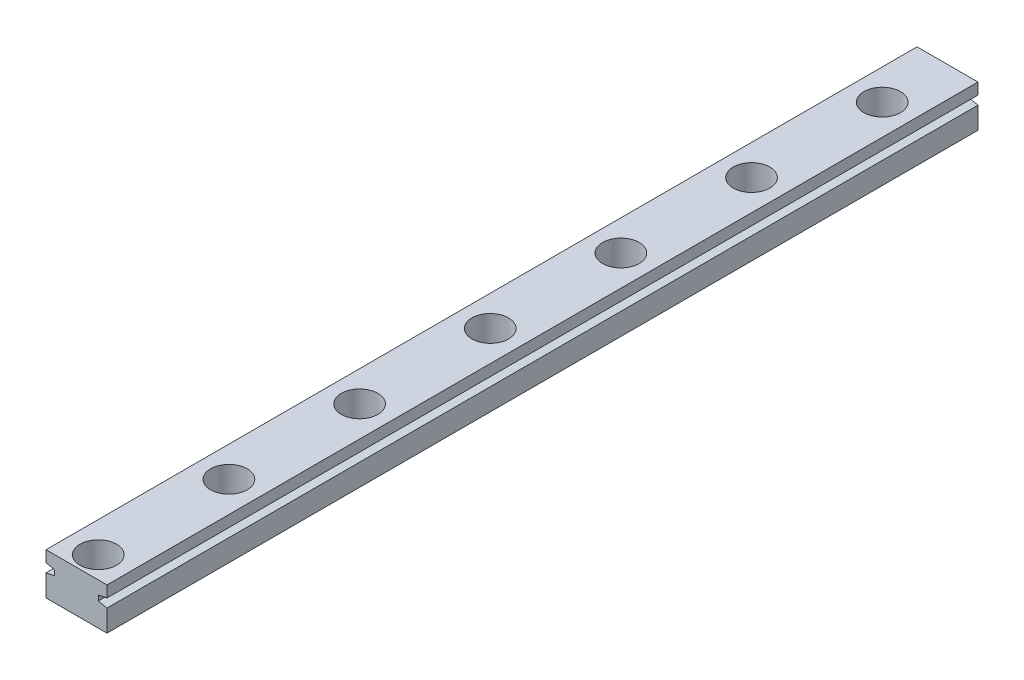
ISO-10303-21;
HEADER;
FILE_DESCRIPTION(('STEP AP214'),'2;1');
FILE_NAME('part.step','',(''),(''),'','','');
FILE_SCHEMA(('AUTOMOTIVE_DESIGN { 1 0 10303 214 1 1 1 1 }'));
ENDSEC;
DATA;
#1=APPLICATION_CONTEXT('core data for automotive mechanical design processes');
#2=APPLICATION_PROTOCOL_DEFINITION('international standard','automotive_design',2000,#1);
#3=PRODUCT_CONTEXT('',#1,'mechanical');
#4=PRODUCT('Part','Part','',(#3));
#5=PRODUCT_RELATED_PRODUCT_CATEGORY('part','',(#4));
#6=PRODUCT_DEFINITION_FORMATION('','',#4);
#7=PRODUCT_DEFINITION_CONTEXT('part definition',#1,'design');
#8=PRODUCT_DEFINITION('design','',#6,#7);
#9=PRODUCT_DEFINITION_SHAPE('','',#8);
#10=(LENGTH_UNIT() NAMED_UNIT(*) SI_UNIT(.MILLI.,.METRE.));
#11=(NAMED_UNIT(*) PLANE_ANGLE_UNIT() SI_UNIT($,.RADIAN.));
#12=(NAMED_UNIT(*) SI_UNIT($,.STERADIAN.) SOLID_ANGLE_UNIT());
#13=UNCERTAINTY_MEASURE_WITH_UNIT(LENGTH_MEASURE(1.E-05),#10,'distance_accuracy_value','');
#14=(GEOMETRIC_REPRESENTATION_CONTEXT(3) GLOBAL_UNCERTAINTY_ASSIGNED_CONTEXT((#13)) GLOBAL_UNIT_ASSIGNED_CONTEXT((#10,
#11,#12)) REPRESENTATION_CONTEXT('',''));
#15=CARTESIAN_POINT('',(0.,0.,0.));
#16=DIRECTION('',(0.,0.,1.));
#17=DIRECTION('',(1.,0.,0.));
#18=AXIS2_PLACEMENT_3D('',#15,#16,#17);
#19=CARTESIAN_POINT('',(3.5,2.4,100.));
#20=DIRECTION('',(-1.,0.,0.));
#21=DIRECTION('',(0.,-1.,0.));
#22=AXIS2_PLACEMENT_3D('',#19,#20,#21);
#23=PLANE('',#22);
#24=DIRECTION('',(0.,1.,0.));
#25=VECTOR('',#24,1.);
#26=CARTESIAN_POINT('',(3.5,2.4,100.));
#27=LINE('',#26,#25);
#28=CARTESIAN_POINT('',(3.5,1.1,100.));
#29=VERTEX_POINT('',#28);
#30=CARTESIAN_POINT('',(3.5,2.4,100.));
#31=VERTEX_POINT('',#30);
#32=EDGE_CURVE('E168',#29,#31,#27,.T.);
#33=ORIENTED_EDGE('',*,*,#32,.F.);
#34=DIRECTION('',(0.,0.,-1.));
#35=VECTOR('',#34,1.);
#36=CARTESIAN_POINT('',(3.5,1.1,100.));
#37=LINE('',#36,#35);
#38=CARTESIAN_POINT('',(3.5,1.1,0.));
#39=VERTEX_POINT('',#38);
#40=EDGE_CURVE('E223',#29,#39,#37,.T.);
#41=ORIENTED_EDGE('',*,*,#40,.T.);
#42=DIRECTION('',(0.,1.,0.));
#43=VECTOR('',#42,1.);
#44=CARTESIAN_POINT('',(3.5,2.4,0.));
#45=LINE('',#44,#43);
#46=CARTESIAN_POINT('',(3.5,2.4,0.));
#47=VERTEX_POINT('',#46);
#48=EDGE_CURVE('E162',#39,#47,#45,.T.);
#49=ORIENTED_EDGE('',*,*,#48,.T.);
#50=DIRECTION('',(0.,0.,-1.));
#51=VECTOR('',#50,1.);
#52=CARTESIAN_POINT('',(3.5,2.4,100.));
#53=LINE('',#52,#51);
#54=EDGE_CURVE('E11',#31,#47,#53,.T.);
#55=ORIENTED_EDGE('',*,*,#54,.F.);
#56=EDGE_LOOP('',(#33,#41,#49,#55));
#57=FACE_BOUND('',#56,.T.);
#58=ADVANCED_FACE('F34',(#57),#23,.F.);
#59=CARTESIAN_POINT('',(-3.5,2.4,100.));
#60=DIRECTION('',(1.,0.,0.));
#61=DIRECTION('',(0.,1.,0.));
#62=AXIS2_PLACEMENT_3D('',#59,#60,#61);
#63=PLANE('',#62);
#64=DIRECTION('',(0.,-1.,0.));
#65=VECTOR('',#64,1.);
#66=CARTESIAN_POINT('',(-3.5,2.4,100.));
#67=LINE('',#66,#65);
#68=CARTESIAN_POINT('',(-3.5,0.100000000000001,100.));
#69=VERTEX_POINT('',#68);
#70=CARTESIAN_POINT('',(-3.5,-2.4,100.));
#71=VERTEX_POINT('',#70);
#72=EDGE_CURVE('E151',#69,#71,#67,.T.);
#73=ORIENTED_EDGE('',*,*,#72,.F.);
#74=DIRECTION('',(0.,0.,-1.));
#75=VECTOR('',#74,1.);
#76=CARTESIAN_POINT('',(-3.5,0.100000000000001,100.));
#77=LINE('',#76,#75);
#78=CARTESIAN_POINT('',(-3.5,0.100000000000001,0.));
#79=VERTEX_POINT('',#78);
#80=EDGE_CURVE('E242',#69,#79,#77,.T.);
#81=ORIENTED_EDGE('',*,*,#80,.T.);
#82=DIRECTION('',(0.,-1.,0.));
#83=VECTOR('',#82,1.);
#84=CARTESIAN_POINT('',(-3.5,2.4,0.));
#85=LINE('',#84,#83);
#86=CARTESIAN_POINT('',(-3.5,-2.4,0.));
#87=VERTEX_POINT('',#86);
#88=EDGE_CURVE('E164',#79,#87,#85,.T.);
#89=ORIENTED_EDGE('',*,*,#88,.T.);
#90=DIRECTION('',(0.,0.,-1.));
#91=VECTOR('',#90,1.);
#92=CARTESIAN_POINT('',(-3.5,-2.4,100.));
#93=LINE('',#92,#91);
#94=EDGE_CURVE('E171',#71,#87,#93,.T.);
#95=ORIENTED_EDGE('',*,*,#94,.F.);
#96=EDGE_LOOP('',(#73,#81,#89,#95));
#97=FACE_BOUND('',#96,.T.);
#98=ADVANCED_FACE('F347',(#97),#63,.F.);
#99=CARTESIAN_POINT('',(9.43618446587006E-13,-2.4,97.5));
#100=DIRECTION('',(0.,1.,0.));
#101=DIRECTION('',(0.,0.,1.));
#102=AXIS2_PLACEMENT_3D('',#99,#100,#101);
#103=CYLINDRICAL_SURFACE('',#102,1.2);
#104=CARTESIAN_POINT('',(9.43618446587006E-13,-2.4,97.5));
#105=DIRECTION('',(0.,1.,0.));
#106=DIRECTION('',(0.,0.,1.));
#107=AXIS2_PLACEMENT_3D('',#104,#105,#106);
#108=CIRCLE('',#107,1.2);
#109=CARTESIAN_POINT('',(9.43618446587006E-13,-2.4,98.7));
#110=VERTEX_POINT('',#109);
#111=EDGE_CURVE('E195',#110,#110,#108,.T.);
#112=ORIENTED_EDGE('',*,*,#111,.F.);
#113=EDGE_LOOP('',(#112));
#114=FACE_BOUND('',#113,.T.);
#115=CARTESIAN_POINT('',(9.43618446587006E-13,-1.1,97.5));
#116=DIRECTION('',(0.,1.,0.));
#117=DIRECTION('',(0.,0.,1.));
#118=AXIS2_PLACEMENT_3D('',#115,#116,#117);
#119=CIRCLE('',#118,1.2);
#120=CARTESIAN_POINT('',(9.43618446587006E-13,-1.1,98.7));
#121=VERTEX_POINT('',#120);
#122=EDGE_CURVE('E38',#121,#121,#119,.F.);
#123=ORIENTED_EDGE('',*,*,#122,.F.);
#124=EDGE_LOOP('',(#123));
#125=FACE_BOUND('',#124,.T.);
#126=ADVANCED_FACE('F351',(#114,#125),#103,.F.);
#127=CARTESIAN_POINT('',(7.86501786339065E-13,-2.4,82.5));
#128=DIRECTION('',(0.,1.,0.));
#129=DIRECTION('',(0.,0.,1.));
#130=AXIS2_PLACEMENT_3D('',#127,#128,#129);
#131=CYLINDRICAL_SURFACE('',#130,1.2);
#132=CARTESIAN_POINT('',(7.86501786339065E-13,-2.4,82.5));
#133=DIRECTION('',(0.,1.,0.));
#134=DIRECTION('',(0.,0.,1.));
#135=AXIS2_PLACEMENT_3D('',#132,#133,#134);
#136=CIRCLE('',#135,1.2);
#137=CARTESIAN_POINT('',(7.86501786339065E-13,-2.4,83.7));
#138=VERTEX_POINT('',#137);
#139=EDGE_CURVE('E199',#138,#138,#136,.T.);
#140=ORIENTED_EDGE('',*,*,#139,.F.);
#141=EDGE_LOOP('',(#140));
#142=FACE_BOUND('',#141,.T.);
#143=CARTESIAN_POINT('',(7.86501786339065E-13,-1.1,82.5));
#144=DIRECTION('',(0.,1.,0.));
#145=DIRECTION('',(0.,0.,1.));
#146=AXIS2_PLACEMENT_3D('',#143,#144,#145);
#147=CIRCLE('',#146,1.2);
#148=CARTESIAN_POINT('',(7.86501786339065E-13,-1.1,83.7));
#149=VERTEX_POINT('',#148);
#150=EDGE_CURVE('E190',#149,#149,#147,.F.);
#151=ORIENTED_EDGE('',*,*,#150,.F.);
#152=EDGE_LOOP('',(#151));
#153=FACE_BOUND('',#152,.T.);
#154=ADVANCED_FACE('F325',(#142,#153),#131,.F.);
#155=CARTESIAN_POINT('',(6.29385126091124E-13,-2.4,67.5));
#156=DIRECTION('',(0.,1.,0.));
#157=DIRECTION('',(0.,0.,1.));
#158=AXIS2_PLACEMENT_3D('',#155,#156,#157);
#159=CYLINDRICAL_SURFACE('',#158,1.2);
#160=CARTESIAN_POINT('',(6.29385126091124E-13,-2.4,67.5));
#161=DIRECTION('',(0.,1.,0.));
#162=DIRECTION('',(0.,0.,1.));
#163=AXIS2_PLACEMENT_3D('',#160,#161,#162);
#164=CIRCLE('',#163,1.2);
#165=CARTESIAN_POINT('',(6.29385126091124E-13,-2.4,68.7));
#166=VERTEX_POINT('',#165);
#167=EDGE_CURVE('E204',#166,#166,#164,.T.);
#168=ORIENTED_EDGE('',*,*,#167,.F.);
#169=EDGE_LOOP('',(#168));
#170=FACE_BOUND('',#169,.T.);
#171=CARTESIAN_POINT('',(6.29385126091124E-13,-1.1,67.5));
#172=DIRECTION('',(0.,1.,0.));
#173=DIRECTION('',(0.,0.,1.));
#174=AXIS2_PLACEMENT_3D('',#171,#172,#173);
#175=CIRCLE('',#174,1.2);
#176=CARTESIAN_POINT('',(6.29385126091124E-13,-1.1,68.7));
#177=VERTEX_POINT('',#176);
#178=EDGE_CURVE('E188',#177,#177,#175,.F.);
#179=ORIENTED_EDGE('',*,*,#178,.F.);
#180=EDGE_LOOP('',(#179));
#181=FACE_BOUND('',#180,.T.);
#182=ADVANCED_FACE('F321',(#170,#181),#159,.F.);
#183=CARTESIAN_POINT('',(4.72268465843183E-13,-2.4,52.5));
#184=DIRECTION('',(0.,1.,0.));
#185=DIRECTION('',(0.,0.,1.));
#186=AXIS2_PLACEMENT_3D('',#183,#184,#185);
#187=CYLINDRICAL_SURFACE('',#186,1.2);
#188=CARTESIAN_POINT('',(4.72268465843183E-13,-2.4,52.5));
#189=DIRECTION('',(0.,1.,0.));
#190=DIRECTION('',(0.,0.,1.));
#191=AXIS2_PLACEMENT_3D('',#188,#189,#190);
#192=CIRCLE('',#191,1.2);
#193=CARTESIAN_POINT('',(4.72268465843183E-13,-2.4,53.7));
#194=VERTEX_POINT('',#193);
#195=EDGE_CURVE('E313',#194,#194,#192,.T.);
#196=ORIENTED_EDGE('',*,*,#195,.F.);
#197=EDGE_LOOP('',(#196));
#198=FACE_BOUND('',#197,.T.);
#199=CARTESIAN_POINT('',(4.72268465843183E-13,-1.1,52.5));
#200=DIRECTION('',(0.,1.,0.));
#201=DIRECTION('',(0.,0.,1.));
#202=AXIS2_PLACEMENT_3D('',#199,#200,#201);
#203=CIRCLE('',#202,1.2);
#204=CARTESIAN_POINT('',(4.72268465843183E-13,-1.1,53.7));
#205=VERTEX_POINT('',#204);
#206=EDGE_CURVE('E185',#205,#205,#203,.F.);
#207=ORIENTED_EDGE('',*,*,#206,.F.);
#208=EDGE_LOOP('',(#207));
#209=FACE_BOUND('',#208,.T.);
#210=ADVANCED_FACE('F324',(#198,#209),#187,.F.);
#211=CARTESIAN_POINT('',(3.15151805595243E-13,-2.4,37.5));
#212=DIRECTION('',(0.,1.,0.));
#213=DIRECTION('',(0.,0.,1.));
#214=AXIS2_PLACEMENT_3D('',#211,#212,#213);
#215=CYLINDRICAL_SURFACE('',#214,1.2);
#216=CARTESIAN_POINT('',(3.15151805595243E-13,-2.4,37.5));
#217=DIRECTION('',(0.,1.,0.));
#218=DIRECTION('',(0.,0.,1.));
#219=AXIS2_PLACEMENT_3D('',#216,#217,#218);
#220=CIRCLE('',#219,1.2);
#221=CARTESIAN_POINT('',(3.15151805595243E-13,-2.4,38.7));
#222=VERTEX_POINT('',#221);
#223=EDGE_CURVE('E310',#222,#222,#220,.T.);
#224=ORIENTED_EDGE('',*,*,#223,.F.);
#225=EDGE_LOOP('',(#224));
#226=FACE_BOUND('',#225,.T.);
#227=CARTESIAN_POINT('',(3.15151805595243E-13,-1.1,37.5));
#228=DIRECTION('',(0.,1.,0.));
#229=DIRECTION('',(0.,0.,1.));
#230=AXIS2_PLACEMENT_3D('',#227,#228,#229);
#231=CIRCLE('',#230,1.2);
#232=CARTESIAN_POINT('',(3.15151805595243E-13,-1.1,38.7));
#233=VERTEX_POINT('',#232);
#234=EDGE_CURVE('E182',#233,#233,#231,.F.);
#235=ORIENTED_EDGE('',*,*,#234,.F.);
#236=EDGE_LOOP('',(#235));
#237=FACE_BOUND('',#236,.T.);
#238=ADVANCED_FACE('F442',(#226,#237),#215,.F.);
#239=CARTESIAN_POINT('',(1.58035145347301E-13,-2.4,22.5));
#240=DIRECTION('',(0.,1.,0.));
#241=DIRECTION('',(0.,0.,1.));
#242=AXIS2_PLACEMENT_3D('',#239,#240,#241);
#243=CYLINDRICAL_SURFACE('',#242,1.2);
#244=CARTESIAN_POINT('',(1.58035145347301E-13,-2.4,22.5));
#245=DIRECTION('',(0.,1.,0.));
#246=DIRECTION('',(0.,0.,1.));
#247=AXIS2_PLACEMENT_3D('',#244,#245,#246);
#248=CIRCLE('',#247,1.2);
#249=CARTESIAN_POINT('',(1.58035145347301E-13,-2.4,23.7));
#250=VERTEX_POINT('',#249);
#251=EDGE_CURVE('E307',#250,#250,#248,.T.);
#252=ORIENTED_EDGE('',*,*,#251,.F.);
#253=EDGE_LOOP('',(#252));
#254=FACE_BOUND('',#253,.T.);
#255=CARTESIAN_POINT('',(1.58035145347301E-13,-1.1,22.5));
#256=DIRECTION('',(0.,1.,0.));
#257=DIRECTION('',(0.,0.,1.));
#258=AXIS2_PLACEMENT_3D('',#255,#256,#257);
#259=CIRCLE('',#258,1.2);
#260=CARTESIAN_POINT('',(1.58035145347301E-13,-1.1,23.7));
#261=VERTEX_POINT('',#260);
#262=EDGE_CURVE('E178',#261,#261,#259,.F.);
#263=ORIENTED_EDGE('',*,*,#262,.F.);
#264=EDGE_LOOP('',(#263));
#265=FACE_BOUND('',#264,.T.);
#266=ADVANCED_FACE('F362',(#254,#265),#243,.F.);
#267=CARTESIAN_POINT('',(0.,-2.4,7.5));
#268=DIRECTION('',(0.,1.,0.));
#269=DIRECTION('',(0.,0.,1.));
#270=AXIS2_PLACEMENT_3D('',#267,#268,#269);
#271=CYLINDRICAL_SURFACE('',#270,1.2);
#272=CARTESIAN_POINT('',(0.,-2.4,7.5));
#273=DIRECTION('',(0.,1.,0.));
#274=DIRECTION('',(0.,0.,1.));
#275=AXIS2_PLACEMENT_3D('',#272,#273,#274);
#276=CIRCLE('',#275,1.2);
#277=CARTESIAN_POINT('',(0.,-2.4,8.7));
#278=VERTEX_POINT('',#277);
#279=EDGE_CURVE('E226',#278,#278,#276,.T.);
#280=ORIENTED_EDGE('',*,*,#279,.F.);
#281=EDGE_LOOP('',(#280));
#282=FACE_BOUND('',#281,.T.);
#283=CARTESIAN_POINT('',(0.,-1.1,7.5));
#284=DIRECTION('',(0.,1.,0.));
#285=DIRECTION('',(0.,0.,1.));
#286=AXIS2_PLACEMENT_3D('',#283,#284,#285);
#287=CIRCLE('',#286,1.2);
#288=CARTESIAN_POINT('',(0.,-1.1,8.7));
#289=VERTEX_POINT('',#288);
#290=EDGE_CURVE('E175',#289,#289,#287,.F.);
#291=ORIENTED_EDGE('',*,*,#290,.F.);
#292=EDGE_LOOP('',(#291));
#293=FACE_BOUND('',#292,.T.);
#294=ADVANCED_FACE('F355',(#282,#293),#271,.F.);
#295=CARTESIAN_POINT('',(3.5,-2.4,0.));
#296=VERTEX_POINT('',#295);
#297=CARTESIAN_POINT('',(3.5,0.0999999999999999,0.));
#298=VERTEX_POINT('',#297);
#299=EDGE_CURVE('E158',#296,#298,#45,.T.);
#300=ORIENTED_EDGE('',*,*,#299,.T.);
#301=DIRECTION('',(0.,0.,-1.));
#302=VECTOR('',#301,1.);
#303=CARTESIAN_POINT('',(3.5,0.0999999999999998,100.));
#304=LINE('',#303,#302);
#305=CARTESIAN_POINT('',(3.5,0.0999999999999998,100.));
#306=VERTEX_POINT('',#305);
#307=EDGE_CURVE('E59',#306,#298,#304,.T.);
#308=ORIENTED_EDGE('',*,*,#307,.F.);
#309=CARTESIAN_POINT('',(3.5,-2.4,100.));
#310=VERTEX_POINT('',#309);
#311=EDGE_CURVE('E207',#310,#306,#27,.T.);
#312=ORIENTED_EDGE('',*,*,#311,.F.);
#313=DIRECTION('',(0.,0.,-1.));
#314=VECTOR('',#313,1.);
#315=CARTESIAN_POINT('',(3.5,-2.4,100.));
#316=LINE('',#315,#314);
#317=EDGE_CURVE('E153',#310,#296,#316,.T.);
#318=ORIENTED_EDGE('',*,*,#317,.T.);
#319=EDGE_LOOP('',(#300,#308,#312,#318));
#320=FACE_BOUND('',#319,.T.);
#321=ADVANCED_FACE('F36',(#320),#23,.F.);
#322=CARTESIAN_POINT('',(-3.5,2.4,100.));
#323=DIRECTION('',(0.,-1.,0.));
#324=DIRECTION('',(0.,0.,-1.));
#325=AXIS2_PLACEMENT_3D('',#322,#323,#324);
#326=PLANE('',#325);
#327=CARTESIAN_POINT('',(0.,2.4,7.5));
#328=DIRECTION('',(0.,1.,0.));
#329=DIRECTION('',(0.,0.,1.));
#330=AXIS2_PLACEMENT_3D('',#327,#328,#329);
#331=CIRCLE('',#330,2.1);
#332=CARTESIAN_POINT('',(0.,2.4,9.6));
#333=VERTEX_POINT('',#332);
#334=EDGE_CURVE('E267',#333,#333,#331,.T.);
#335=ORIENTED_EDGE('',*,*,#334,.F.);
#336=EDGE_LOOP('',(#335));
#337=FACE_BOUND('',#336,.T.);
#338=CARTESIAN_POINT('',(9.43618446587006E-13,2.4,97.5));
#339=DIRECTION('',(0.,1.,0.));
#340=DIRECTION('',(0.,0.,1.));
#341=AXIS2_PLACEMENT_3D('',#338,#339,#340);
#342=CIRCLE('',#341,2.1);
#343=CARTESIAN_POINT('',(9.43618446587006E-13,2.4,99.6));
#344=VERTEX_POINT('',#343);
#345=EDGE_CURVE('E245',#344,#344,#342,.T.);
#346=ORIENTED_EDGE('',*,*,#345,.F.);
#347=EDGE_LOOP('',(#346));
#348=FACE_BOUND('',#347,.T.);
#349=CARTESIAN_POINT('',(7.86501786339065E-13,2.4,82.5));
#350=DIRECTION('',(0.,1.,0.));
#351=DIRECTION('',(0.,0.,1.));
#352=AXIS2_PLACEMENT_3D('',#349,#350,#351);
#353=CIRCLE('',#352,2.1);
#354=CARTESIAN_POINT('',(7.86501786339065E-13,2.4,84.6));
#355=VERTEX_POINT('',#354);
#356=EDGE_CURVE('E281',#355,#355,#353,.T.);
#357=ORIENTED_EDGE('',*,*,#356,.F.);
#358=EDGE_LOOP('',(#357));
#359=FACE_BOUND('',#358,.T.);
#360=CARTESIAN_POINT('',(6.29385126091124E-13,2.4,67.5));
#361=DIRECTION('',(0.,1.,0.));
#362=DIRECTION('',(0.,0.,1.));
#363=AXIS2_PLACEMENT_3D('',#360,#361,#362);
#364=CIRCLE('',#363,2.1);
#365=CARTESIAN_POINT('',(6.29385126091124E-13,2.4,69.6));
#366=VERTEX_POINT('',#365);
#367=EDGE_CURVE('E275',#366,#366,#364,.T.);
#368=ORIENTED_EDGE('',*,*,#367,.F.);
#369=EDGE_LOOP('',(#368));
#370=FACE_BOUND('',#369,.T.);
#371=CARTESIAN_POINT('',(1.58035145347301E-13,2.4,22.5));
#372=DIRECTION('',(0.,1.,0.));
#373=DIRECTION('',(0.,0.,1.));
#374=AXIS2_PLACEMENT_3D('',#371,#372,#373);
#375=CIRCLE('',#374,2.1);
#376=CARTESIAN_POINT('',(1.58035145347301E-13,2.4,24.6));
#377=VERTEX_POINT('',#376);
#378=EDGE_CURVE('E292',#377,#377,#375,.T.);
#379=ORIENTED_EDGE('',*,*,#378,.F.);
#380=EDGE_LOOP('',(#379));
#381=FACE_BOUND('',#380,.T.);
#382=CARTESIAN_POINT('',(3.15151805595243E-13,2.4,37.5));
#383=DIRECTION('',(0.,1.,0.));
#384=DIRECTION('',(0.,0.,1.));
#385=AXIS2_PLACEMENT_3D('',#382,#383,#384);
#386=CIRCLE('',#385,2.1);
#387=CARTESIAN_POINT('',(3.15151805595243E-13,2.4,39.6));
#388=VERTEX_POINT('',#387);
#389=EDGE_CURVE('E293',#388,#388,#386,.T.);
#390=ORIENTED_EDGE('',*,*,#389,.F.);
#391=EDGE_LOOP('',(#390));
#392=FACE_BOUND('',#391,.T.);
#393=CARTESIAN_POINT('',(4.72268465843183E-13,2.4,52.5));
#394=DIRECTION('',(0.,1.,0.));
#395=DIRECTION('',(0.,0.,1.));
#396=AXIS2_PLACEMENT_3D('',#393,#394,#395);
#397=CIRCLE('',#396,2.1);
#398=CARTESIAN_POINT('',(4.72268465843183E-13,2.4,54.6));
#399=VERTEX_POINT('',#398);
#400=EDGE_CURVE('E274',#399,#399,#397,.T.);
#401=ORIENTED_EDGE('',*,*,#400,.F.);
#402=EDGE_LOOP('',(#401));
#403=FACE_BOUND('',#402,.T.);
#404=DIRECTION('',(-1.,0.,0.));
#405=VECTOR('',#404,1.);
#406=CARTESIAN_POINT('',(-3.5,2.4,0.));
#407=LINE('',#406,#405);
#408=CARTESIAN_POINT('',(-3.5,2.4,0.));
#409=VERTEX_POINT('',#408);
#410=EDGE_CURVE('E161',#47,#409,#407,.T.);
#411=ORIENTED_EDGE('',*,*,#410,.T.);
#412=DIRECTION('',(0.,0.,-1.));
#413=VECTOR('',#412,1.);
#414=CARTESIAN_POINT('',(-3.5,2.4,100.));
#415=LINE('',#414,#413);
#416=CARTESIAN_POINT('',(-3.5,2.4,100.));
#417=VERTEX_POINT('',#416);
#418=EDGE_CURVE('E43',#417,#409,#415,.T.);
#419=ORIENTED_EDGE('',*,*,#418,.F.);
#420=DIRECTION('',(-1.,0.,0.));
#421=VECTOR('',#420,1.);
#422=CARTESIAN_POINT('',(-3.5,2.4,100.));
#423=LINE('',#422,#421);
#424=EDGE_CURVE('E148',#31,#417,#423,.T.);
#425=ORIENTED_EDGE('',*,*,#424,.F.);
#426=ORIENTED_EDGE('',*,*,#54,.T.);
#427=EDGE_LOOP('',(#411,#419,#425,#426));
#428=FACE_BOUND('',#427,.T.);
#429=ADVANCED_FACE('F220',(#337,#348,#359,#370,#381,#392,#403,#428),#326,.F.);
#430=CARTESIAN_POINT('',(-3.5,1.1,0.));
#431=VERTEX_POINT('',#430);
#432=EDGE_CURVE('E142',#409,#431,#85,.T.);
#433=ORIENTED_EDGE('',*,*,#432,.T.);
#434=DIRECTION('',(0.,0.,-1.));
#435=VECTOR('',#434,1.);
#436=CARTESIAN_POINT('',(-3.5,1.1,100.));
#437=LINE('',#436,#435);
#438=CARTESIAN_POINT('',(-3.5,1.1,100.));
#439=VERTEX_POINT('',#438);
#440=EDGE_CURVE('E51',#439,#431,#437,.T.);
#441=ORIENTED_EDGE('',*,*,#440,.F.);
#442=EDGE_CURVE('E140',#417,#439,#67,.T.);
#443=ORIENTED_EDGE('',*,*,#442,.F.);
#444=ORIENTED_EDGE('',*,*,#418,.T.);
#445=EDGE_LOOP('',(#433,#441,#443,#444));
#446=FACE_BOUND('',#445,.T.);
#447=ADVANCED_FACE('F138',(#446),#63,.F.);
#448=CARTESIAN_POINT('',(-3.5,-2.4,100.));
#449=DIRECTION('',(0.,1.,0.));
#450=DIRECTION('',(0.,0.,1.));
#451=AXIS2_PLACEMENT_3D('',#448,#449,#450);
#452=PLANE('',#451);
#453=ORIENTED_EDGE('',*,*,#279,.T.);
#454=EDGE_LOOP('',(#453));
#455=FACE_BOUND('',#454,.T.);
#456=ORIENTED_EDGE('',*,*,#251,.T.);
#457=EDGE_LOOP('',(#456));
#458=FACE_BOUND('',#457,.T.);
#459=ORIENTED_EDGE('',*,*,#223,.T.);
#460=EDGE_LOOP('',(#459));
#461=FACE_BOUND('',#460,.T.);
#462=ORIENTED_EDGE('',*,*,#195,.T.);
#463=EDGE_LOOP('',(#462));
#464=FACE_BOUND('',#463,.T.);
#465=ORIENTED_EDGE('',*,*,#167,.T.);
#466=EDGE_LOOP('',(#465));
#467=FACE_BOUND('',#466,.T.);
#468=ORIENTED_EDGE('',*,*,#139,.T.);
#469=EDGE_LOOP('',(#468));
#470=FACE_BOUND('',#469,.T.);
#471=ORIENTED_EDGE('',*,*,#111,.T.);
#472=EDGE_LOOP('',(#471));
#473=FACE_BOUND('',#472,.T.);
#474=DIRECTION('',(1.,0.,0.));
#475=VECTOR('',#474,1.);
#476=CARTESIAN_POINT('',(-3.5,-2.4,0.));
#477=LINE('',#476,#475);
#478=EDGE_CURVE('E166',#87,#296,#477,.T.);
#479=ORIENTED_EDGE('',*,*,#478,.T.);
#480=ORIENTED_EDGE('',*,*,#317,.F.);
#481=DIRECTION('',(1.,0.,0.));
#482=VECTOR('',#481,1.);
#483=CARTESIAN_POINT('',(-3.5,-2.4,100.));
#484=LINE('',#483,#482);
#485=EDGE_CURVE('E150',#71,#310,#484,.T.);
#486=ORIENTED_EDGE('',*,*,#485,.F.);
#487=ORIENTED_EDGE('',*,*,#94,.T.);
#488=EDGE_LOOP('',(#479,#480,#486,#487));
#489=FACE_BOUND('',#488,.T.);
#490=ADVANCED_FACE('F318',(#455,#458,#461,#464,#467,#470,#473,#489),#452,.F.);
#491=CARTESIAN_POINT('',(0.,0.,100.));
#492=DIRECTION('',(0.,0.,1.));
#493=DIRECTION('',(1.,0.,0.));
#494=AXIS2_PLACEMENT_3D('',#491,#492,#493);
#495=PLANE('',#494);
#496=DIRECTION('',(-0.98058067569092,-0.196116135138184,0.));
#497=VECTOR('',#496,1.);
#498=CARTESIAN_POINT('',(-2.5,0.300000000000001,100.));
#499=LINE('',#498,#497);
#500=CARTESIAN_POINT('',(-2.5,0.300000000000001,100.));
#501=VERTEX_POINT('',#500);
#502=EDGE_CURVE('E143',#501,#69,#499,.T.);
#503=ORIENTED_EDGE('',*,*,#502,.T.);
#504=ORIENTED_EDGE('',*,*,#72,.T.);
#505=ORIENTED_EDGE('',*,*,#485,.T.);
#506=ORIENTED_EDGE('',*,*,#311,.T.);
#507=DIRECTION('',(-0.98058067569092,0.196116135138184,0.));
#508=VECTOR('',#507,1.);
#509=CARTESIAN_POINT('',(2.5,0.3,100.));
#510=LINE('',#509,#508);
#511=CARTESIAN_POINT('',(2.5,0.3,100.));
#512=VERTEX_POINT('',#511);
#513=EDGE_CURVE('E249',#306,#512,#510,.T.);
#514=ORIENTED_EDGE('',*,*,#513,.T.);
#515=DIRECTION('',(0.,1.,0.));
#516=VECTOR('',#515,1.);
#517=CARTESIAN_POINT('',(2.5,0.900000000000001,100.));
#518=LINE('',#517,#516);
#519=CARTESIAN_POINT('',(2.5,0.900000000000001,100.));
#520=VERTEX_POINT('',#519);
#521=EDGE_CURVE('E251',#512,#520,#518,.T.);
#522=ORIENTED_EDGE('',*,*,#521,.T.);
#523=DIRECTION('',(0.98058067569092,0.196116135138184,0.));
#524=VECTOR('',#523,1.);
#525=CARTESIAN_POINT('',(3.5,1.1,100.));
#526=LINE('',#525,#524);
#527=EDGE_CURVE('E215',#520,#29,#526,.T.);
#528=ORIENTED_EDGE('',*,*,#527,.T.);
#529=ORIENTED_EDGE('',*,*,#32,.T.);
#530=ORIENTED_EDGE('',*,*,#424,.T.);
#531=ORIENTED_EDGE('',*,*,#442,.T.);
#532=DIRECTION('',(0.98058067569092,-0.196116135138184,0.));
#533=VECTOR('',#532,1.);
#534=CARTESIAN_POINT('',(-3.5,1.1,100.));
#535=LINE('',#534,#533);
#536=CARTESIAN_POINT('',(-2.5,0.900000000000001,100.));
#537=VERTEX_POINT('',#536);
#538=EDGE_CURVE('E125',#439,#537,#535,.T.);
#539=ORIENTED_EDGE('',*,*,#538,.T.);
#540=DIRECTION('',(0.,-1.,0.));
#541=VECTOR('',#540,1.);
#542=CARTESIAN_POINT('',(-2.5,0.900000000000001,100.));
#543=LINE('',#542,#541);
#544=EDGE_CURVE('E132',#537,#501,#543,.T.);
#545=ORIENTED_EDGE('',*,*,#544,.T.);
#546=EDGE_LOOP('',(#503,#504,#505,#506,#514,#522,#528,#529,#530,#531,#539,#545));
#547=FACE_BOUND('',#546,.T.);
#548=ADVANCED_FACE('F146',(#547),#495,.T.);
#549=CARTESIAN_POINT('',(0.,0.,0.));
#550=DIRECTION('',(0.,0.,1.));
#551=DIRECTION('',(1.,0.,0.));
#552=AXIS2_PLACEMENT_3D('',#549,#550,#551);
#553=PLANE('',#552);
#554=ORIENTED_EDGE('',*,*,#88,.F.);
#555=DIRECTION('',(-0.98058067569092,-0.196116135138184,0.));
#556=VECTOR('',#555,1.);
#557=CARTESIAN_POINT('',(-2.5,0.300000000000001,0.));
#558=LINE('',#557,#556);
#559=CARTESIAN_POINT('',(-2.5,0.300000000000001,0.));
#560=VERTEX_POINT('',#559);
#561=EDGE_CURVE('E133',#560,#79,#558,.T.);
#562=ORIENTED_EDGE('',*,*,#561,.F.);
#563=DIRECTION('',(0.,-1.,0.));
#564=VECTOR('',#563,1.);
#565=CARTESIAN_POINT('',(-2.5,0.900000000000001,0.));
#566=LINE('',#565,#564);
#567=CARTESIAN_POINT('',(-2.5,0.900000000000001,0.));
#568=VERTEX_POINT('',#567);
#569=EDGE_CURVE('E233',#568,#560,#566,.T.);
#570=ORIENTED_EDGE('',*,*,#569,.F.);
#571=DIRECTION('',(0.98058067569092,-0.196116135138184,0.));
#572=VECTOR('',#571,1.);
#573=CARTESIAN_POINT('',(-3.5,1.1,0.));
#574=LINE('',#573,#572);
#575=EDGE_CURVE('E230',#431,#568,#574,.T.);
#576=ORIENTED_EDGE('',*,*,#575,.F.);
#577=ORIENTED_EDGE('',*,*,#432,.F.);
#578=ORIENTED_EDGE('',*,*,#410,.F.);
#579=ORIENTED_EDGE('',*,*,#48,.F.);
#580=DIRECTION('',(0.98058067569092,0.196116135138184,0.));
#581=VECTOR('',#580,1.);
#582=CARTESIAN_POINT('',(3.5,1.1,0.));
#583=LINE('',#582,#581);
#584=CARTESIAN_POINT('',(2.5,0.900000000000001,0.));
#585=VERTEX_POINT('',#584);
#586=EDGE_CURVE('E252',#585,#39,#583,.T.);
#587=ORIENTED_EDGE('',*,*,#586,.F.);
#588=DIRECTION('',(0.,1.,0.));
#589=VECTOR('',#588,1.);
#590=CARTESIAN_POINT('',(2.5,0.900000000000001,0.));
#591=LINE('',#590,#589);
#592=CARTESIAN_POINT('',(2.5,0.3,0.));
#593=VERTEX_POINT('',#592);
#594=EDGE_CURVE('E257',#593,#585,#591,.T.);
#595=ORIENTED_EDGE('',*,*,#594,.F.);
#596=DIRECTION('',(-0.98058067569092,0.196116135138184,0.));
#597=VECTOR('',#596,1.);
#598=CARTESIAN_POINT('',(2.5,0.3,0.));
#599=LINE('',#598,#597);
#600=EDGE_CURVE('E255',#298,#593,#599,.T.);
#601=ORIENTED_EDGE('',*,*,#600,.F.);
#602=ORIENTED_EDGE('',*,*,#299,.F.);
#603=ORIENTED_EDGE('',*,*,#478,.F.);
#604=EDGE_LOOP('',(#554,#562,#570,#576,#577,#578,#579,#587,#595,#601,#602,#603));
#605=FACE_BOUND('',#604,.T.);
#606=ADVANCED_FACE('F228',(#605),#553,.F.);
#607=CARTESIAN_POINT('',(0.,-1.1,7.5));
#608=DIRECTION('',(0.,1.,0.));
#609=DIRECTION('',(0.,0.,1.));
#610=AXIS2_PLACEMENT_3D('',#607,#608,#609);
#611=PLANE('',#610);
#612=CARTESIAN_POINT('',(0.,-1.1,7.5));
#613=DIRECTION('',(0.,1.,0.));
#614=DIRECTION('',(0.,0.,1.));
#615=AXIS2_PLACEMENT_3D('',#612,#613,#614);
#616=CIRCLE('',#615,2.1);
#617=CARTESIAN_POINT('',(0.,-1.1,9.6));
#618=VERTEX_POINT('',#617);
#619=EDGE_CURVE('E179',#618,#618,#616,.T.);
#620=ORIENTED_EDGE('',*,*,#619,.T.);
#621=EDGE_LOOP('',(#620));
#622=FACE_BOUND('',#621,.T.);
#623=ORIENTED_EDGE('',*,*,#290,.T.);
#624=EDGE_LOOP('',(#623));
#625=FACE_BOUND('',#624,.T.);
#626=ADVANCED_FACE('F392',(#622,#625),#611,.T.);
#627=CARTESIAN_POINT('',(0.,-1.1,7.5));
#628=DIRECTION('',(0.,1.,0.));
#629=DIRECTION('',(0.,0.,1.));
#630=AXIS2_PLACEMENT_3D('',#627,#628,#629);
#631=CYLINDRICAL_SURFACE('',#630,2.1);
#632=ORIENTED_EDGE('',*,*,#619,.F.);
#633=EDGE_LOOP('',(#632));
#634=FACE_BOUND('',#633,.T.);
#635=ORIENTED_EDGE('',*,*,#334,.T.);
#636=EDGE_LOOP('',(#635));
#637=FACE_BOUND('',#636,.T.);
#638=ADVANCED_FACE('F394',(#634,#637),#631,.F.);
#639=CARTESIAN_POINT('',(1.58035145347301E-13,-1.1,22.5));
#640=DIRECTION('',(0.,1.,0.));
#641=DIRECTION('',(0.,0.,1.));
#642=AXIS2_PLACEMENT_3D('',#639,#640,#641);
#643=PLANE('',#642);
#644=CARTESIAN_POINT('',(1.58035145347301E-13,-1.1,22.5));
#645=DIRECTION('',(0.,1.,0.));
#646=DIRECTION('',(0.,0.,1.));
#647=AXIS2_PLACEMENT_3D('',#644,#645,#646);
#648=CIRCLE('',#647,2.1);
#649=CARTESIAN_POINT('',(1.58035145347301E-13,-1.1,24.6));
#650=VERTEX_POINT('',#649);
#651=EDGE_CURVE('E270',#650,#650,#648,.T.);
#652=ORIENTED_EDGE('',*,*,#651,.T.);
#653=EDGE_LOOP('',(#652));
#654=FACE_BOUND('',#653,.T.);
#655=ORIENTED_EDGE('',*,*,#262,.T.);
#656=EDGE_LOOP('',(#655));
#657=FACE_BOUND('',#656,.T.);
#658=ADVANCED_FACE('F397',(#654,#657),#643,.T.);
#659=CARTESIAN_POINT('',(1.58035145347301E-13,-1.1,22.5));
#660=DIRECTION('',(0.,1.,0.));
#661=DIRECTION('',(0.,0.,1.));
#662=AXIS2_PLACEMENT_3D('',#659,#660,#661);
#663=CYLINDRICAL_SURFACE('',#662,2.1);
#664=ORIENTED_EDGE('',*,*,#651,.F.);
#665=EDGE_LOOP('',(#664));
#666=FACE_BOUND('',#665,.T.);
#667=ORIENTED_EDGE('',*,*,#378,.T.);
#668=EDGE_LOOP('',(#667));
#669=FACE_BOUND('',#668,.T.);
#670=ADVANCED_FACE('F402',(#666,#669),#663,.F.);
#671=CARTESIAN_POINT('',(3.15151805595243E-13,-1.1,37.5));
#672=DIRECTION('',(0.,1.,0.));
#673=DIRECTION('',(0.,0.,1.));
#674=AXIS2_PLACEMENT_3D('',#671,#672,#673);
#675=PLANE('',#674);
#676=CARTESIAN_POINT('',(3.15151805595243E-13,-1.1,37.5));
#677=DIRECTION('',(0.,1.,0.));
#678=DIRECTION('',(0.,0.,1.));
#679=AXIS2_PLACEMENT_3D('',#676,#677,#678);
#680=CIRCLE('',#679,2.1);
#681=CARTESIAN_POINT('',(3.15151805595243E-13,-1.1,39.6));
#682=VERTEX_POINT('',#681);
#683=EDGE_CURVE('E289',#682,#682,#680,.T.);
#684=ORIENTED_EDGE('',*,*,#683,.T.);
#685=EDGE_LOOP('',(#684));
#686=FACE_BOUND('',#685,.T.);
#687=ORIENTED_EDGE('',*,*,#234,.T.);
#688=EDGE_LOOP('',(#687));
#689=FACE_BOUND('',#688,.T.);
#690=ADVANCED_FACE('F424',(#686,#689),#675,.T.);
#691=CARTESIAN_POINT('',(3.15151805595243E-13,-1.1,37.5));
#692=DIRECTION('',(0.,1.,0.));
#693=DIRECTION('',(0.,0.,1.));
#694=AXIS2_PLACEMENT_3D('',#691,#692,#693);
#695=CYLINDRICAL_SURFACE('',#694,2.1);
#696=ORIENTED_EDGE('',*,*,#683,.F.);
#697=EDGE_LOOP('',(#696));
#698=FACE_BOUND('',#697,.T.);
#699=ORIENTED_EDGE('',*,*,#389,.T.);
#700=EDGE_LOOP('',(#699));
#701=FACE_BOUND('',#700,.T.);
#702=ADVANCED_FACE('F422',(#698,#701),#695,.F.);
#703=CARTESIAN_POINT('',(4.72268465843183E-13,-1.1,52.5));
#704=DIRECTION('',(0.,1.,0.));
#705=DIRECTION('',(0.,0.,1.));
#706=AXIS2_PLACEMENT_3D('',#703,#704,#705);
#707=PLANE('',#706);
#708=CARTESIAN_POINT('',(4.72268465843183E-13,-1.1,52.5));
#709=DIRECTION('',(0.,1.,0.));
#710=DIRECTION('',(0.,0.,1.));
#711=AXIS2_PLACEMENT_3D('',#708,#709,#710);
#712=CIRCLE('',#711,2.1);
#713=CARTESIAN_POINT('',(4.72268465843183E-13,-1.1,54.6));
#714=VERTEX_POINT('',#713);
#715=EDGE_CURVE('E296',#714,#714,#712,.T.);
#716=ORIENTED_EDGE('',*,*,#715,.T.);
#717=EDGE_LOOP('',(#716));
#718=FACE_BOUND('',#717,.T.);
#719=ORIENTED_EDGE('',*,*,#206,.T.);
#720=EDGE_LOOP('',(#719));
#721=FACE_BOUND('',#720,.T.);
#722=ADVANCED_FACE('F342',(#718,#721),#707,.T.);
#723=CARTESIAN_POINT('',(4.72268465843183E-13,-1.1,52.5));
#724=DIRECTION('',(0.,1.,0.));
#725=DIRECTION('',(0.,0.,1.));
#726=AXIS2_PLACEMENT_3D('',#723,#724,#725);
#727=CYLINDRICAL_SURFACE('',#726,2.1);
#728=ORIENTED_EDGE('',*,*,#715,.F.);
#729=EDGE_LOOP('',(#728));
#730=FACE_BOUND('',#729,.T.);
#731=ORIENTED_EDGE('',*,*,#400,.T.);
#732=EDGE_LOOP('',(#731));
#733=FACE_BOUND('',#732,.T.);
#734=ADVANCED_FACE('F332',(#730,#733),#727,.F.);
#735=CARTESIAN_POINT('',(6.29385126091124E-13,-1.1,67.5));
#736=DIRECTION('',(0.,1.,0.));
#737=DIRECTION('',(0.,0.,1.));
#738=AXIS2_PLACEMENT_3D('',#735,#736,#737);
#739=PLANE('',#738);
#740=CARTESIAN_POINT('',(6.29385126091124E-13,-1.1,67.5));
#741=DIRECTION('',(0.,1.,0.));
#742=DIRECTION('',(0.,0.,1.));
#743=AXIS2_PLACEMENT_3D('',#740,#741,#742);
#744=CIRCLE('',#743,2.1);
#745=CARTESIAN_POINT('',(6.29385126091124E-13,-1.1,69.6));
#746=VERTEX_POINT('',#745);
#747=EDGE_CURVE('E271',#746,#746,#744,.T.);
#748=ORIENTED_EDGE('',*,*,#747,.T.);
#749=EDGE_LOOP('',(#748));
#750=FACE_BOUND('',#749,.T.);
#751=ORIENTED_EDGE('',*,*,#178,.T.);
#752=EDGE_LOOP('',(#751));
#753=FACE_BOUND('',#752,.T.);
#754=ADVANCED_FACE('F329',(#750,#753),#739,.T.);
#755=CARTESIAN_POINT('',(6.29385126091124E-13,-1.1,67.5));
#756=DIRECTION('',(0.,1.,0.));
#757=DIRECTION('',(0.,0.,1.));
#758=AXIS2_PLACEMENT_3D('',#755,#756,#757);
#759=CYLINDRICAL_SURFACE('',#758,2.1);
#760=ORIENTED_EDGE('',*,*,#747,.F.);
#761=EDGE_LOOP('',(#760));
#762=FACE_BOUND('',#761,.T.);
#763=ORIENTED_EDGE('',*,*,#367,.T.);
#764=EDGE_LOOP('',(#763));
#765=FACE_BOUND('',#764,.T.);
#766=ADVANCED_FACE('F331',(#762,#765),#759,.F.);
#767=CARTESIAN_POINT('',(7.86501786339065E-13,-1.1,82.5));
#768=DIRECTION('',(0.,1.,0.));
#769=DIRECTION('',(0.,0.,1.));
#770=AXIS2_PLACEMENT_3D('',#767,#768,#769);
#771=PLANE('',#770);
#772=CARTESIAN_POINT('',(7.86501786339065E-13,-1.1,82.5));
#773=DIRECTION('',(0.,1.,0.));
#774=DIRECTION('',(0.,0.,1.));
#775=AXIS2_PLACEMENT_3D('',#772,#773,#774);
#776=CIRCLE('',#775,2.1);
#777=CARTESIAN_POINT('',(7.86501786339065E-13,-1.1,84.6));
#778=VERTEX_POINT('',#777);
#779=EDGE_CURVE('E278',#778,#778,#776,.T.);
#780=ORIENTED_EDGE('',*,*,#779,.T.);
#781=EDGE_LOOP('',(#780));
#782=FACE_BOUND('',#781,.T.);
#783=ORIENTED_EDGE('',*,*,#150,.T.);
#784=EDGE_LOOP('',(#783));
#785=FACE_BOUND('',#784,.T.);
#786=ADVANCED_FACE('F339',(#782,#785),#771,.T.);
#787=CARTESIAN_POINT('',(7.86501786339065E-13,-1.1,82.5));
#788=DIRECTION('',(0.,1.,0.));
#789=DIRECTION('',(0.,0.,1.));
#790=AXIS2_PLACEMENT_3D('',#787,#788,#789);
#791=CYLINDRICAL_SURFACE('',#790,2.1);
#792=ORIENTED_EDGE('',*,*,#779,.F.);
#793=EDGE_LOOP('',(#792));
#794=FACE_BOUND('',#793,.T.);
#795=ORIENTED_EDGE('',*,*,#356,.T.);
#796=EDGE_LOOP('',(#795));
#797=FACE_BOUND('',#796,.T.);
#798=ADVANCED_FACE('F545',(#794,#797),#791,.F.);
#799=CARTESIAN_POINT('',(9.43618446587006E-13,-1.1,97.5));
#800=DIRECTION('',(0.,1.,0.));
#801=DIRECTION('',(0.,0.,1.));
#802=AXIS2_PLACEMENT_3D('',#799,#800,#801);
#803=PLANE('',#802);
#804=CARTESIAN_POINT('',(9.43618446587006E-13,-1.1,97.5));
#805=DIRECTION('',(0.,1.,0.));
#806=DIRECTION('',(0.,0.,1.));
#807=AXIS2_PLACEMENT_3D('',#804,#805,#806);
#808=CIRCLE('',#807,2.1);
#809=CARTESIAN_POINT('',(9.43618446587006E-13,-1.1,99.6));
#810=VERTEX_POINT('',#809);
#811=EDGE_CURVE('E284',#810,#810,#808,.T.);
#812=ORIENTED_EDGE('',*,*,#811,.T.);
#813=EDGE_LOOP('',(#812));
#814=FACE_BOUND('',#813,.T.);
#815=ORIENTED_EDGE('',*,*,#122,.T.);
#816=EDGE_LOOP('',(#815));
#817=FACE_BOUND('',#816,.T.);
#818=ADVANCED_FACE('F383',(#814,#817),#803,.T.);
#819=CARTESIAN_POINT('',(9.43618446587006E-13,-1.1,97.5));
#820=DIRECTION('',(0.,1.,0.));
#821=DIRECTION('',(0.,0.,1.));
#822=AXIS2_PLACEMENT_3D('',#819,#820,#821);
#823=CYLINDRICAL_SURFACE('',#822,2.1);
#824=ORIENTED_EDGE('',*,*,#811,.F.);
#825=EDGE_LOOP('',(#824));
#826=FACE_BOUND('',#825,.T.);
#827=ORIENTED_EDGE('',*,*,#345,.T.);
#828=EDGE_LOOP('',(#827));
#829=FACE_BOUND('',#828,.T.);
#830=ADVANCED_FACE('F376',(#826,#829),#823,.F.);
#831=CARTESIAN_POINT('',(3.5,1.1,100.));
#832=DIRECTION('',(-0.196116135138184,0.98058067569092,0.));
#833=DIRECTION('',(-0.98058067569092,-0.196116135138184,0.));
#834=AXIS2_PLACEMENT_3D('',#831,#832,#833);
#835=PLANE('',#834);
#836=ORIENTED_EDGE('',*,*,#586,.T.);
#837=ORIENTED_EDGE('',*,*,#40,.F.);
#838=ORIENTED_EDGE('',*,*,#527,.F.);
#839=DIRECTION('',(0.,0.,-1.));
#840=VECTOR('',#839,1.);
#841=CARTESIAN_POINT('',(2.5,0.900000000000001,100.));
#842=LINE('',#841,#840);
#843=EDGE_CURVE('E236',#520,#585,#842,.T.);
#844=ORIENTED_EDGE('',*,*,#843,.T.);
#845=EDGE_LOOP('',(#836,#837,#838,#844));
#846=FACE_BOUND('',#845,.T.);
#847=ADVANCED_FACE('F374',(#846),#835,.F.);
#848=CARTESIAN_POINT('',(2.5,0.900000000000001,100.));
#849=DIRECTION('',(-1.,0.,0.));
#850=DIRECTION('',(0.,0.,1.));
#851=AXIS2_PLACEMENT_3D('',#848,#849,#850);
#852=PLANE('',#851);
#853=ORIENTED_EDGE('',*,*,#594,.T.);
#854=ORIENTED_EDGE('',*,*,#843,.F.);
#855=ORIENTED_EDGE('',*,*,#521,.F.);
#856=DIRECTION('',(0.,0.,-1.));
#857=VECTOR('',#856,1.);
#858=CARTESIAN_POINT('',(2.5,0.3,100.));
#859=LINE('',#858,#857);
#860=EDGE_CURVE('E262',#512,#593,#859,.T.);
#861=ORIENTED_EDGE('',*,*,#860,.T.);
#862=EDGE_LOOP('',(#853,#854,#855,#861));
#863=FACE_BOUND('',#862,.T.);
#864=ADVANCED_FACE('F372',(#863),#852,.F.);
#865=CARTESIAN_POINT('',(2.5,0.3,100.));
#866=DIRECTION('',(-0.196116135138184,-0.98058067569092,0.));
#867=DIRECTION('',(0.98058067569092,-0.196116135138184,0.));
#868=AXIS2_PLACEMENT_3D('',#865,#866,#867);
#869=PLANE('',#868);
#870=ORIENTED_EDGE('',*,*,#600,.T.);
#871=ORIENTED_EDGE('',*,*,#860,.F.);
#872=ORIENTED_EDGE('',*,*,#513,.F.);
#873=ORIENTED_EDGE('',*,*,#307,.T.);
#874=EDGE_LOOP('',(#870,#871,#872,#873));
#875=FACE_BOUND('',#874,.T.);
#876=ADVANCED_FACE('F369',(#875),#869,.F.);
#877=CARTESIAN_POINT('',(-2.5,0.300000000000001,100.));
#878=DIRECTION('',(0.196116135138184,-0.98058067569092,0.));
#879=DIRECTION('',(0.98058067569092,0.196116135138184,0.));
#880=AXIS2_PLACEMENT_3D('',#877,#878,#879);
#881=PLANE('',#880);
#882=ORIENTED_EDGE('',*,*,#561,.T.);
#883=ORIENTED_EDGE('',*,*,#80,.F.);
#884=ORIENTED_EDGE('',*,*,#502,.F.);
#885=DIRECTION('',(0.,0.,-1.));
#886=VECTOR('',#885,1.);
#887=CARTESIAN_POINT('',(-2.5,0.300000000000001,100.));
#888=LINE('',#887,#886);
#889=EDGE_CURVE('E246',#501,#560,#888,.T.);
#890=ORIENTED_EDGE('',*,*,#889,.T.);
#891=EDGE_LOOP('',(#882,#883,#884,#890));
#892=FACE_BOUND('',#891,.T.);
#893=ADVANCED_FACE('F391',(#892),#881,.F.);
#894=CARTESIAN_POINT('',(-2.5,0.900000000000001,100.));
#895=DIRECTION('',(1.,0.,0.));
#896=DIRECTION('',(0.,0.,-1.));
#897=AXIS2_PLACEMENT_3D('',#894,#895,#896);
#898=PLANE('',#897);
#899=ORIENTED_EDGE('',*,*,#569,.T.);
#900=ORIENTED_EDGE('',*,*,#889,.F.);
#901=ORIENTED_EDGE('',*,*,#544,.F.);
#902=DIRECTION('',(0.,0.,-1.));
#903=VECTOR('',#902,1.);
#904=CARTESIAN_POINT('',(-2.5,0.900000000000001,100.));
#905=LINE('',#904,#903);
#906=EDGE_CURVE('E127',#537,#568,#905,.T.);
#907=ORIENTED_EDGE('',*,*,#906,.T.);
#908=EDGE_LOOP('',(#899,#900,#901,#907));
#909=FACE_BOUND('',#908,.T.);
#910=ADVANCED_FACE('F657',(#909),#898,.F.);
#911=CARTESIAN_POINT('',(-3.5,1.1,100.));
#912=DIRECTION('',(0.196116135138184,0.98058067569092,0.));
#913=DIRECTION('',(-0.98058067569092,0.196116135138184,0.));
#914=AXIS2_PLACEMENT_3D('',#911,#912,#913);
#915=PLANE('',#914);
#916=ORIENTED_EDGE('',*,*,#575,.T.);
#917=ORIENTED_EDGE('',*,*,#906,.F.);
#918=ORIENTED_EDGE('',*,*,#538,.F.);
#919=ORIENTED_EDGE('',*,*,#440,.T.);
#920=EDGE_LOOP('',(#916,#917,#918,#919));
#921=FACE_BOUND('',#920,.T.);
#922=ADVANCED_FACE('F126',(#921),#915,.F.);
#923=CLOSED_SHELL('',(#58,#98,#126,#154,#182,#210,#238,#266,#294,#321,#429,#447,#490,#548,#606,
#626,#638,#658,#670,#690,#702,#722,#734,#754,#766,#786,#798,#818,#830,#847,#864,#876,#893,#910,#922));
#924=MANIFOLD_SOLID_BREP('B2',#923);
#925=ADVANCED_BREP_SHAPE_REPRESENTATION('',(#18,#924),#14);
#926=SHAPE_DEFINITION_REPRESENTATION(#9,#925);
ENDSEC;
END-ISO-10303-21;
